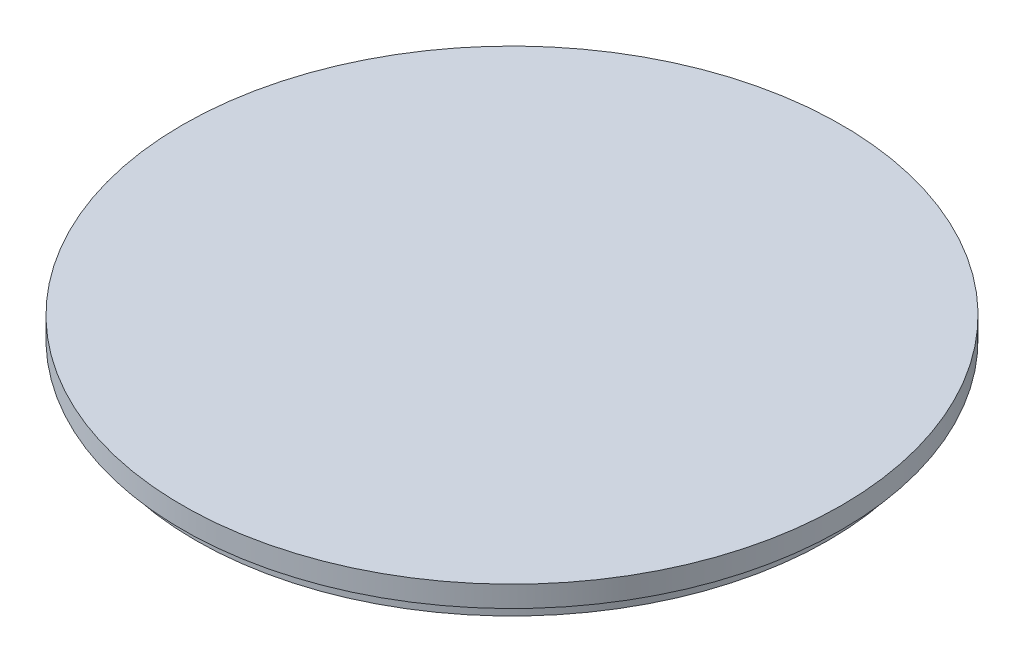
ISO-10303-21;
HEADER;
FILE_DESCRIPTION(('STEP AP214'),'2;1');
FILE_NAME('part.step','',(''),(''),'','','');
FILE_SCHEMA(('AUTOMOTIVE_DESIGN { 1 0 10303 214 1 1 1 1 }'));
ENDSEC;
DATA;
#1=APPLICATION_CONTEXT('core data for automotive mechanical design processes');
#2=APPLICATION_PROTOCOL_DEFINITION('international standard','automotive_design',2000,#1);
#3=PRODUCT_CONTEXT('',#1,'mechanical');
#4=PRODUCT('Part','Part','',(#3));
#5=PRODUCT_RELATED_PRODUCT_CATEGORY('part','',(#4));
#6=PRODUCT_DEFINITION_FORMATION('','',#4);
#7=PRODUCT_DEFINITION_CONTEXT('part definition',#1,'design');
#8=PRODUCT_DEFINITION('design','',#6,#7);
#9=PRODUCT_DEFINITION_SHAPE('','',#8);
#10=(LENGTH_UNIT() NAMED_UNIT(*) SI_UNIT(.MILLI.,.METRE.));
#11=(NAMED_UNIT(*) PLANE_ANGLE_UNIT() SI_UNIT($,.RADIAN.));
#12=(NAMED_UNIT(*) SI_UNIT($,.STERADIAN.) SOLID_ANGLE_UNIT());
#13=UNCERTAINTY_MEASURE_WITH_UNIT(LENGTH_MEASURE(1.E-05),#10,'distance_accuracy_value','');
#14=(GEOMETRIC_REPRESENTATION_CONTEXT(3) GLOBAL_UNCERTAINTY_ASSIGNED_CONTEXT((#13)) GLOBAL_UNIT_ASSIGNED_CONTEXT((#10,
#11,#12)) REPRESENTATION_CONTEXT('',''));
#15=CARTESIAN_POINT('',(0.,0.,0.));
#16=DIRECTION('',(0.,0.,1.));
#17=DIRECTION('',(1.,0.,0.));
#18=AXIS2_PLACEMENT_3D('',#15,#16,#17);
#19=CARTESIAN_POINT('',(-58.2679491924311,0.,0.));
#20=DIRECTION('',(0.,1.,0.));
#21=DIRECTION('',(-1.,0.,0.));
#22=AXIS2_PLACEMENT_3D('',#19,#20,#21);
#23=PLANE('',#22);
#24=CARTESIAN_POINT('',(0.,0.,0.));
#25=DIRECTION('',(0.,-1.,0.));
#26=DIRECTION('',(1.,0.,0.));
#27=AXIS2_PLACEMENT_3D('',#24,#25,#26);
#28=CIRCLE('',#27,58.2679491924311);
#29=CARTESIAN_POINT('',(58.2679491924311,0.,0.));
#30=VERTEX_POINT('',#29);
#31=EDGE_CURVE('E64',#30,#30,#28,.T.);
#32=ORIENTED_EDGE('',*,*,#31,.T.);
#33=EDGE_LOOP('',(#32));
#34=FACE_BOUND('',#33,.T.);
#35=ADVANCED_FACE('F41',(#34),#23,.F.);
#36=CARTESIAN_POINT('',(0.,4.,0.));
#37=DIRECTION('',(0.,-1.,0.));
#38=DIRECTION('',(1.,0.,0.));
#39=AXIS2_PLACEMENT_3D('',#36,#37,#38);
#40=PLANE('',#39);
#41=CARTESIAN_POINT('',(0.,4.,0.));
#42=DIRECTION('',(0.,-1.,0.));
#43=DIRECTION('',(1.,0.,0.));
#44=AXIS2_PLACEMENT_3D('',#41,#42,#43);
#45=CIRCLE('',#44,62.5);
#46=CARTESIAN_POINT('',(62.5,4.,0.));
#47=VERTEX_POINT('',#46);
#48=EDGE_CURVE('E10',#47,#47,#45,.T.);
#49=ORIENTED_EDGE('',*,*,#48,.F.);
#50=EDGE_LOOP('',(#49));
#51=FACE_BOUND('',#50,.T.);
#52=ADVANCED_FACE('F89',(#51),#40,.F.);
#53=CARTESIAN_POINT('',(0.,0.,0.));
#54=DIRECTION('',(0.,-1.,0.));
#55=DIRECTION('',(1.,0.,0.));
#56=AXIS2_PLACEMENT_3D('',#53,#54,#55);
#57=CYLINDRICAL_SURFACE('',#56,62.5);
#58=CARTESIAN_POINT('',(0.,0.,0.));
#59=DIRECTION('',(0.,-1.,0.));
#60=DIRECTION('',(1.,0.,0.));
#61=AXIS2_PLACEMENT_3D('',#58,#59,#60);
#62=CIRCLE('',#61,62.5);
#63=CARTESIAN_POINT('',(62.5,0.,0.));
#64=VERTEX_POINT('',#63);
#65=EDGE_CURVE('E48',#64,#64,#62,.T.);
#66=ORIENTED_EDGE('',*,*,#65,.F.);
#67=EDGE_LOOP('',(#66));
#68=FACE_BOUND('',#67,.T.);
#69=ORIENTED_EDGE('',*,*,#48,.T.);
#70=EDGE_LOOP('',(#69));
#71=FACE_BOUND('',#70,.T.);
#72=ADVANCED_FACE('F84',(#68,#71),#57,.T.);
#73=CARTESIAN_POINT('',(-62.5,0.,0.));
#74=DIRECTION('',(0.,1.,0.));
#75=DIRECTION('',(-1.,0.,0.));
#76=AXIS2_PLACEMENT_3D('',#73,#74,#75);
#77=PLANE('',#76);
#78=CARTESIAN_POINT('',(0.,0.,0.));
#79=DIRECTION('',(0.,-1.,0.));
#80=DIRECTION('',(1.,0.,0.));
#81=AXIS2_PLACEMENT_3D('',#78,#79,#80);
#82=CIRCLE('',#81,60.);
#83=CARTESIAN_POINT('',(60.,0.,0.));
#84=VERTEX_POINT('',#83);
#85=EDGE_CURVE('E53',#84,#84,#82,.T.);
#86=ORIENTED_EDGE('',*,*,#85,.F.);
#87=EDGE_LOOP('',(#86));
#88=FACE_BOUND('',#87,.T.);
#89=ORIENTED_EDGE('',*,*,#65,.T.);
#90=EDGE_LOOP('',(#89));
#91=FACE_BOUND('',#90,.T.);
#92=ADVANCED_FACE('F79',(#88,#91),#77,.F.);
#93=CARTESIAN_POINT('',(0.,0.,0.));
#94=DIRECTION('',(0.,-1.,0.));
#95=DIRECTION('',(1.,0.,0.));
#96=AXIS2_PLACEMENT_3D('',#93,#94,#95);
#97=CYLINDRICAL_SURFACE('',#96,60.);
#98=CARTESIAN_POINT('',(0.,-3.,0.));
#99=DIRECTION('',(0.,-1.,0.));
#100=DIRECTION('',(1.,0.,0.));
#101=AXIS2_PLACEMENT_3D('',#98,#99,#100);
#102=CIRCLE('',#101,60.);
#103=CARTESIAN_POINT('',(60.,-3.,0.));
#104=VERTEX_POINT('',#103);
#105=EDGE_CURVE('E58',#104,#104,#102,.T.);
#106=ORIENTED_EDGE('',*,*,#105,.F.);
#107=EDGE_LOOP('',(#106));
#108=FACE_BOUND('',#107,.T.);
#109=ORIENTED_EDGE('',*,*,#85,.T.);
#110=EDGE_LOOP('',(#109));
#111=FACE_BOUND('',#110,.T.);
#112=ADVANCED_FACE('F73',(#108,#111),#97,.T.);
#113=CARTESIAN_POINT('',(0.,-3.,0.));
#114=DIRECTION('',(0.,-1.,0.));
#115=DIRECTION('',(1.,0.,0.));
#116=AXIS2_PLACEMENT_3D('',#113,#114,#115);
#117=CONICAL_SURFACE('',#116,60.,0.523598775598297);
#118=ORIENTED_EDGE('',*,*,#31,.F.);
#119=EDGE_LOOP('',(#118));
#120=FACE_BOUND('',#119,.T.);
#121=ORIENTED_EDGE('',*,*,#105,.T.);
#122=EDGE_LOOP('',(#121));
#123=FACE_BOUND('',#122,.T.);
#124=ADVANCED_FACE('F70',(#120,#123),#117,.F.);
#125=CLOSED_SHELL('',(#35,#52,#72,#92,#112,#124));
#126=MANIFOLD_SOLID_BREP('B2',#125);
#127=ADVANCED_BREP_SHAPE_REPRESENTATION('',(#18,#126),#14);
#128=SHAPE_DEFINITION_REPRESENTATION(#9,#127);
ENDSEC;
END-ISO-10303-21;
